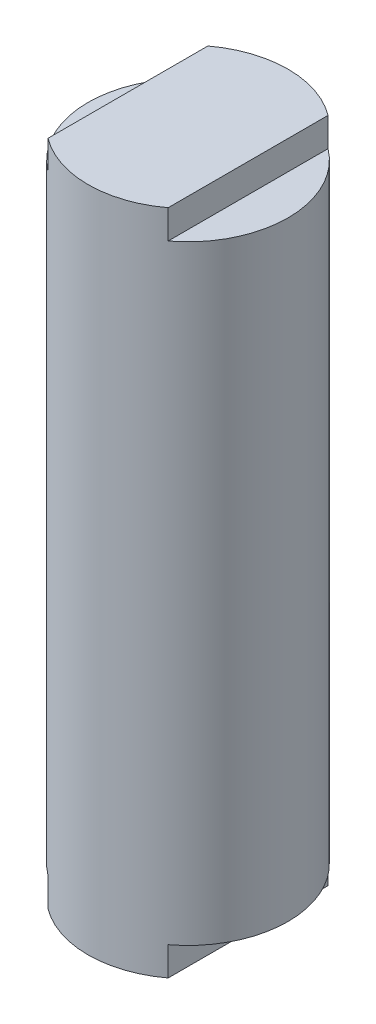
ISO-10303-21;
HEADER;
FILE_DESCRIPTION(('STEP AP214'),'2;1');
FILE_NAME('part.step','',(''),(''),'','','');
FILE_SCHEMA(('AUTOMOTIVE_DESIGN { 1 0 10303 214 1 1 1 1 }'));
ENDSEC;
DATA;
#1=APPLICATION_CONTEXT('core data for automotive mechanical design processes');
#2=APPLICATION_PROTOCOL_DEFINITION('international standard','automotive_design',2000,#1);
#3=PRODUCT_CONTEXT('',#1,'mechanical');
#4=PRODUCT('Part','Part','',(#3));
#5=PRODUCT_RELATED_PRODUCT_CATEGORY('part','',(#4));
#6=PRODUCT_DEFINITION_FORMATION('','',#4);
#7=PRODUCT_DEFINITION_CONTEXT('part definition',#1,'design');
#8=PRODUCT_DEFINITION('design','',#6,#7);
#9=PRODUCT_DEFINITION_SHAPE('','',#8);
#10=(LENGTH_UNIT() NAMED_UNIT(*) SI_UNIT(.MILLI.,.METRE.));
#11=(NAMED_UNIT(*) PLANE_ANGLE_UNIT() SI_UNIT($,.RADIAN.));
#12=(NAMED_UNIT(*) SI_UNIT($,.STERADIAN.) SOLID_ANGLE_UNIT());
#13=UNCERTAINTY_MEASURE_WITH_UNIT(LENGTH_MEASURE(1.E-05),#10,'distance_accuracy_value','');
#14=(GEOMETRIC_REPRESENTATION_CONTEXT(3) GLOBAL_UNCERTAINTY_ASSIGNED_CONTEXT((#13)) GLOBAL_UNIT_ASSIGNED_CONTEXT((#10,
#11,#12)) REPRESENTATION_CONTEXT('',''));
#15=CARTESIAN_POINT('',(0.,0.,0.));
#16=DIRECTION('',(0.,0.,1.));
#17=DIRECTION('',(1.,0.,0.));
#18=AXIS2_PLACEMENT_3D('',#15,#16,#17);
#19=CARTESIAN_POINT('',(0.,88.10625,0.));
#20=DIRECTION('',(0.,-1.,0.));
#21=DIRECTION('',(0.,0.,-1.));
#22=AXIS2_PLACEMENT_3D('',#19,#20,#21);
#23=CYLINDRICAL_SURFACE('',#22,26.415);
#24=DIRECTION('',(0.,-1.,0.));
#25=VECTOR('',#24,1.);
#26=CARTESIAN_POINT('',(-15.874,88.10625,-21.1132268732186));
#27=LINE('',#26,#25);
#28=CARTESIAN_POINT('',(-15.874,88.10625,-21.1132268732186));
#29=VERTEX_POINT('',#28);
#30=CARTESIAN_POINT('',(-15.874,80.48625,-21.1132268732186));
#31=VERTEX_POINT('',#30);
#32=EDGE_CURVE('E125',#29,#31,#27,.T.);
#33=ORIENTED_EDGE('',*,*,#32,.F.);
#34=CARTESIAN_POINT('',(0.,88.10625,0.));
#35=DIRECTION('',(0.,1.,0.));
#36=DIRECTION('',(0.,0.,1.));
#37=AXIS2_PLACEMENT_3D('',#34,#35,#36);
#38=CIRCLE('',#37,26.415);
#39=CARTESIAN_POINT('',(15.874,88.10625,-21.1132268732186));
#40=VERTEX_POINT('',#39);
#41=EDGE_CURVE('E137',#40,#29,#38,.T.);
#42=ORIENTED_EDGE('',*,*,#41,.F.);
#43=DIRECTION('',(0.,-1.,0.));
#44=VECTOR('',#43,1.);
#45=CARTESIAN_POINT('',(15.874,88.10625,-21.1132268732186));
#46=LINE('',#45,#44);
#47=CARTESIAN_POINT('',(15.874,80.48625,-21.1132268732186));
#48=VERTEX_POINT('',#47);
#49=EDGE_CURVE('E134',#40,#48,#46,.T.);
#50=ORIENTED_EDGE('',*,*,#49,.T.);
#51=CARTESIAN_POINT('',(0.,80.48625,0.));
#52=DIRECTION('',(0.,-1.,0.));
#53=DIRECTION('',(0.,0.,-1.));
#54=AXIS2_PLACEMENT_3D('',#51,#52,#53);
#55=CIRCLE('',#54,26.415);
#56=CARTESIAN_POINT('',(15.874,80.48625,21.1132268732186));
#57=VERTEX_POINT('',#56);
#58=EDGE_CURVE('E145',#48,#57,#55,.T.);
#59=ORIENTED_EDGE('',*,*,#58,.T.);
#60=DIRECTION('',(0.,-1.,0.));
#61=VECTOR('',#60,1.);
#62=CARTESIAN_POINT('',(15.874,88.10625,21.1132268732186));
#63=LINE('',#62,#61);
#64=CARTESIAN_POINT('',(15.874,88.10625,21.1132268732186));
#65=VERTEX_POINT('',#64);
#66=EDGE_CURVE('E131',#57,#65,#63,.F.);
#67=ORIENTED_EDGE('',*,*,#66,.T.);
#68=CARTESIAN_POINT('',(-15.874,88.10625,21.1132268732186));
#69=VERTEX_POINT('',#68);
#70=EDGE_CURVE('E141',#69,#65,#38,.T.);
#71=ORIENTED_EDGE('',*,*,#70,.F.);
#72=DIRECTION('',(0.,-1.,0.));
#73=VECTOR('',#72,1.);
#74=CARTESIAN_POINT('',(-15.874,88.10625,21.1132268732186));
#75=LINE('',#74,#73);
#76=CARTESIAN_POINT('',(-15.874,80.48625,21.1132268732186));
#77=VERTEX_POINT('',#76);
#78=EDGE_CURVE('E123',#77,#69,#75,.F.);
#79=ORIENTED_EDGE('',*,*,#78,.F.);
#80=CARTESIAN_POINT('',(0.,80.48625,0.));
#81=DIRECTION('',(0.,1.,0.));
#82=DIRECTION('',(0.,0.,1.));
#83=AXIS2_PLACEMENT_3D('',#80,#81,#82);
#84=CIRCLE('',#83,26.415);
#85=EDGE_CURVE('E151',#31,#77,#84,.T.);
#86=ORIENTED_EDGE('',*,*,#85,.F.);
#87=EDGE_LOOP('',(#33,#42,#50,#59,#67,#71,#79,#86));
#88=FACE_BOUND('',#87,.T.);
#89=CARTESIAN_POINT('',(0.,-80.48625,0.));
#90=DIRECTION('',(0.,1.,0.));
#91=DIRECTION('',(0.,0.,1.));
#92=AXIS2_PLACEMENT_3D('',#89,#90,#91);
#93=CIRCLE('',#92,26.415);
#94=CARTESIAN_POINT('',(-15.874,-80.48625,-21.1132268732186));
#95=VERTEX_POINT('',#94);
#96=CARTESIAN_POINT('',(-15.874,-80.48625,21.1132268732186));
#97=VERTEX_POINT('',#96);
#98=EDGE_CURVE('E11',#95,#97,#93,.T.);
#99=ORIENTED_EDGE('',*,*,#98,.T.);
#100=DIRECTION('',(0.,-1.,0.));
#101=VECTOR('',#100,1.);
#102=CARTESIAN_POINT('',(-15.874,88.10625,21.1132268732186));
#103=LINE('',#102,#101);
#104=CARTESIAN_POINT('',(-15.874,-88.10625,21.1132268732186));
#105=VERTEX_POINT('',#104);
#106=EDGE_CURVE('E103',#97,#105,#103,.T.);
#107=ORIENTED_EDGE('',*,*,#106,.T.);
#108=CARTESIAN_POINT('',(0.,-88.10625,0.));
#109=DIRECTION('',(0.,1.,0.));
#110=DIRECTION('',(0.,0.,1.));
#111=AXIS2_PLACEMENT_3D('',#108,#109,#110);
#112=CIRCLE('',#111,26.415);
#113=CARTESIAN_POINT('',(15.874,-88.10625,21.1132268732186));
#114=VERTEX_POINT('',#113);
#115=EDGE_CURVE('E56',#105,#114,#112,.T.);
#116=ORIENTED_EDGE('',*,*,#115,.T.);
#117=DIRECTION('',(0.,-1.,0.));
#118=VECTOR('',#117,1.);
#119=CARTESIAN_POINT('',(15.874,88.10625,21.1132268732186));
#120=LINE('',#119,#118);
#121=CARTESIAN_POINT('',(15.874,-80.48625,21.1132268732186));
#122=VERTEX_POINT('',#121);
#123=EDGE_CURVE('E118',#122,#114,#120,.T.);
#124=ORIENTED_EDGE('',*,*,#123,.F.);
#125=CARTESIAN_POINT('',(0.,-80.48625,0.));
#126=DIRECTION('',(0.,-1.,0.));
#127=DIRECTION('',(0.,0.,-1.));
#128=AXIS2_PLACEMENT_3D('',#125,#126,#127);
#129=CIRCLE('',#128,26.415);
#130=CARTESIAN_POINT('',(15.874,-80.48625,-21.1132268732186));
#131=VERTEX_POINT('',#130);
#132=EDGE_CURVE('E155',#131,#122,#129,.T.);
#133=ORIENTED_EDGE('',*,*,#132,.F.);
#134=DIRECTION('',(0.,-1.,0.));
#135=VECTOR('',#134,1.);
#136=CARTESIAN_POINT('',(15.874,88.10625,-21.1132268732186));
#137=LINE('',#136,#135);
#138=CARTESIAN_POINT('',(15.874,-88.10625,-21.1132268732186));
#139=VERTEX_POINT('',#138);
#140=EDGE_CURVE('E115',#139,#131,#137,.F.);
#141=ORIENTED_EDGE('',*,*,#140,.F.);
#142=CARTESIAN_POINT('',(-15.874,-88.10625,-21.1132268732186));
#143=VERTEX_POINT('',#142);
#144=EDGE_CURVE('E108',#139,#143,#112,.T.);
#145=ORIENTED_EDGE('',*,*,#144,.T.);
#146=DIRECTION('',(0.,-1.,0.));
#147=VECTOR('',#146,1.);
#148=CARTESIAN_POINT('',(-15.874,88.10625,-21.1132268732186));
#149=LINE('',#148,#147);
#150=EDGE_CURVE('E48',#143,#95,#149,.F.);
#151=ORIENTED_EDGE('',*,*,#150,.T.);
#152=EDGE_LOOP('',(#99,#107,#116,#124,#133,#141,#145,#151));
#153=FACE_BOUND('',#152,.T.);
#154=ADVANCED_FACE('F34',(#88,#153),#23,.T.);
#155=CARTESIAN_POINT('',(0.,-88.10625,0.));
#156=DIRECTION('',(0.,1.,0.));
#157=DIRECTION('',(0.,0.,1.));
#158=AXIS2_PLACEMENT_3D('',#155,#156,#157);
#159=PLANE('',#158);
#160=ORIENTED_EDGE('',*,*,#115,.F.);
#161=DIRECTION('',(0.,0.,-1.));
#162=VECTOR('',#161,1.);
#163=CARTESIAN_POINT('',(-15.874,-88.10625,0.));
#164=LINE('',#163,#162);
#165=EDGE_CURVE('E41',#105,#143,#164,.T.);
#166=ORIENTED_EDGE('',*,*,#165,.T.);
#167=ORIENTED_EDGE('',*,*,#144,.F.);
#168=DIRECTION('',(0.,0.,-1.));
#169=VECTOR('',#168,1.);
#170=CARTESIAN_POINT('',(15.874,-88.10625,0.));
#171=LINE('',#170,#169);
#172=EDGE_CURVE('E153',#114,#139,#171,.T.);
#173=ORIENTED_EDGE('',*,*,#172,.F.);
#174=EDGE_LOOP('',(#160,#166,#167,#173));
#175=FACE_BOUND('',#174,.T.);
#176=ADVANCED_FACE('F157',(#175),#159,.F.);
#177=CARTESIAN_POINT('',(0.,88.10625,0.));
#178=DIRECTION('',(0.,1.,0.));
#179=DIRECTION('',(0.,0.,1.));
#180=AXIS2_PLACEMENT_3D('',#177,#178,#179);
#181=PLANE('',#180);
#182=ORIENTED_EDGE('',*,*,#41,.T.);
#183=DIRECTION('',(0.,0.,1.));
#184=VECTOR('',#183,1.);
#185=CARTESIAN_POINT('',(-15.874,88.10625,0.));
#186=LINE('',#185,#184);
#187=EDGE_CURVE('E148',#29,#69,#186,.T.);
#188=ORIENTED_EDGE('',*,*,#187,.T.);
#189=ORIENTED_EDGE('',*,*,#70,.T.);
#190=DIRECTION('',(0.,0.,1.));
#191=VECTOR('',#190,1.);
#192=CARTESIAN_POINT('',(15.874,88.10625,0.));
#193=LINE('',#192,#191);
#194=EDGE_CURVE('E140',#40,#65,#193,.T.);
#195=ORIENTED_EDGE('',*,*,#194,.F.);
#196=EDGE_LOOP('',(#182,#188,#189,#195));
#197=FACE_BOUND('',#196,.T.);
#198=ADVANCED_FACE('F180',(#197),#181,.T.);
#199=CARTESIAN_POINT('',(26.415,80.48625,-26.415));
#200=DIRECTION('',(0.,-1.,0.));
#201=DIRECTION('',(0.,0.,-1.));
#202=AXIS2_PLACEMENT_3D('',#199,#200,#201);
#203=PLANE('',#202);
#204=DIRECTION('',(0.,0.,1.));
#205=VECTOR('',#204,1.);
#206=CARTESIAN_POINT('',(15.874,80.48625,-26.415));
#207=LINE('',#206,#205);
#208=EDGE_CURVE('E128',#48,#57,#207,.T.);
#209=ORIENTED_EDGE('',*,*,#208,.T.);
#210=ORIENTED_EDGE('',*,*,#58,.F.);
#211=EDGE_LOOP('',(#209,#210));
#212=FACE_BOUND('',#211,.T.);
#213=ADVANCED_FACE('F192',(#212),#203,.F.);
#214=CARTESIAN_POINT('',(15.874,88.10625,-26.415));
#215=DIRECTION('',(-1.,0.,0.));
#216=DIRECTION('',(0.,0.,1.));
#217=AXIS2_PLACEMENT_3D('',#214,#215,#216);
#218=PLANE('',#217);
#219=ORIENTED_EDGE('',*,*,#194,.T.);
#220=ORIENTED_EDGE('',*,*,#66,.F.);
#221=ORIENTED_EDGE('',*,*,#208,.F.);
#222=ORIENTED_EDGE('',*,*,#49,.F.);
#223=EDGE_LOOP('',(#219,#220,#221,#222));
#224=FACE_BOUND('',#223,.T.);
#225=ADVANCED_FACE('F189',(#224),#218,.F.);
#226=CARTESIAN_POINT('',(-26.415,80.48625,-26.415));
#227=DIRECTION('',(0.,1.,0.));
#228=DIRECTION('',(0.,0.,1.));
#229=AXIS2_PLACEMENT_3D('',#226,#227,#228);
#230=PLANE('',#229);
#231=DIRECTION('',(0.,0.,1.));
#232=VECTOR('',#231,1.);
#233=CARTESIAN_POINT('',(-15.874,80.48625,-26.415));
#234=LINE('',#233,#232);
#235=EDGE_CURVE('E120',#31,#77,#234,.T.);
#236=ORIENTED_EDGE('',*,*,#235,.F.);
#237=ORIENTED_EDGE('',*,*,#85,.T.);
#238=EDGE_LOOP('',(#236,#237));
#239=FACE_BOUND('',#238,.T.);
#240=ADVANCED_FACE('F172',(#239),#230,.T.);
#241=CARTESIAN_POINT('',(-15.874,88.10625,-26.415));
#242=DIRECTION('',(-1.,0.,0.));
#243=DIRECTION('',(0.,0.,1.));
#244=AXIS2_PLACEMENT_3D('',#241,#242,#243);
#245=PLANE('',#244);
#246=ORIENTED_EDGE('',*,*,#32,.T.);
#247=ORIENTED_EDGE('',*,*,#235,.T.);
#248=ORIENTED_EDGE('',*,*,#78,.T.);
#249=ORIENTED_EDGE('',*,*,#187,.F.);
#250=EDGE_LOOP('',(#246,#247,#248,#249));
#251=FACE_BOUND('',#250,.T.);
#252=ADVANCED_FACE('F165',(#251),#245,.T.);
#253=CARTESIAN_POINT('',(26.415,-80.48625,-26.415));
#254=DIRECTION('',(0.,-1.,0.));
#255=DIRECTION('',(0.,0.,-1.));
#256=AXIS2_PLACEMENT_3D('',#253,#254,#255);
#257=PLANE('',#256);
#258=DIRECTION('',(0.,0.,1.));
#259=VECTOR('',#258,1.);
#260=CARTESIAN_POINT('',(15.874,-80.48625,-26.415));
#261=LINE('',#260,#259);
#262=EDGE_CURVE('E110',#131,#122,#261,.T.);
#263=ORIENTED_EDGE('',*,*,#262,.F.);
#264=ORIENTED_EDGE('',*,*,#132,.T.);
#265=EDGE_LOOP('',(#263,#264));
#266=FACE_BOUND('',#265,.T.);
#267=ADVANCED_FACE('F163',(#266),#257,.T.);
#268=CARTESIAN_POINT('',(15.874,-88.10625,-26.415));
#269=DIRECTION('',(1.,0.,0.));
#270=DIRECTION('',(0.,0.,-1.));
#271=AXIS2_PLACEMENT_3D('',#268,#269,#270);
#272=PLANE('',#271);
#273=ORIENTED_EDGE('',*,*,#123,.T.);
#274=ORIENTED_EDGE('',*,*,#172,.T.);
#275=ORIENTED_EDGE('',*,*,#140,.T.);
#276=ORIENTED_EDGE('',*,*,#262,.T.);
#277=EDGE_LOOP('',(#273,#274,#275,#276));
#278=FACE_BOUND('',#277,.T.);
#279=ADVANCED_FACE('F160',(#278),#272,.T.);
#280=CARTESIAN_POINT('',(-26.415,-80.48625,-26.415));
#281=DIRECTION('',(0.,1.,0.));
#282=DIRECTION('',(0.,0.,1.));
#283=AXIS2_PLACEMENT_3D('',#280,#281,#282);
#284=PLANE('',#283);
#285=DIRECTION('',(0.,0.,1.));
#286=VECTOR('',#285,1.);
#287=CARTESIAN_POINT('',(-15.874,-80.48625,-26.415));
#288=LINE('',#287,#286);
#289=EDGE_CURVE('E100',#95,#97,#288,.T.);
#290=ORIENTED_EDGE('',*,*,#289,.T.);
#291=ORIENTED_EDGE('',*,*,#98,.F.);
#292=EDGE_LOOP('',(#290,#291));
#293=FACE_BOUND('',#292,.T.);
#294=ADVANCED_FACE('F99',(#293),#284,.F.);
#295=CARTESIAN_POINT('',(-15.874,-88.10625,-26.415));
#296=DIRECTION('',(1.,0.,0.));
#297=DIRECTION('',(0.,0.,-1.));
#298=AXIS2_PLACEMENT_3D('',#295,#296,#297);
#299=PLANE('',#298);
#300=ORIENTED_EDGE('',*,*,#289,.F.);
#301=ORIENTED_EDGE('',*,*,#150,.F.);
#302=ORIENTED_EDGE('',*,*,#165,.F.);
#303=ORIENTED_EDGE('',*,*,#106,.F.);
#304=EDGE_LOOP('',(#300,#301,#302,#303));
#305=FACE_BOUND('',#304,.T.);
#306=ADVANCED_FACE('F102',(#305),#299,.F.);
#307=CLOSED_SHELL('',(#154,#176,#198,#213,#225,#240,#252,#267,#279,#294,#306));
#308=MANIFOLD_SOLID_BREP('B2',#307);
#309=ADVANCED_BREP_SHAPE_REPRESENTATION('',(#18,#308),#14);
#310=SHAPE_DEFINITION_REPRESENTATION(#9,#309);
ENDSEC;
END-ISO-10303-21;
